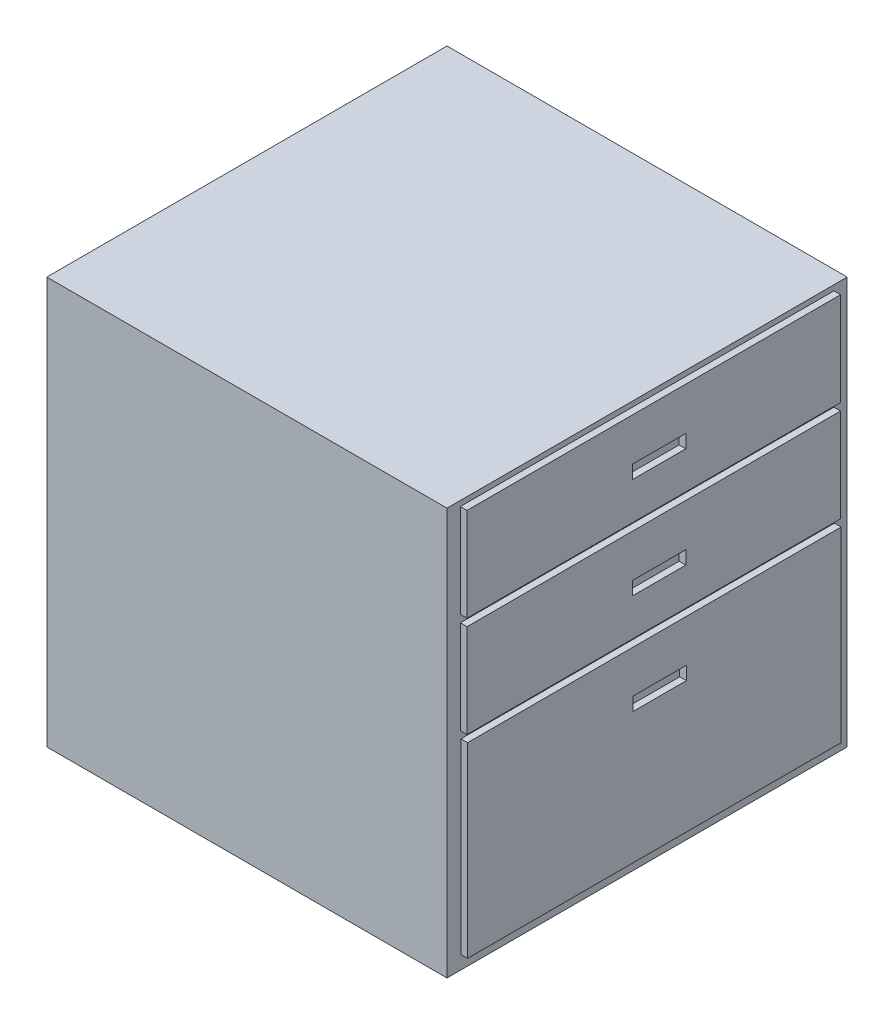
ISO-10303-21;
HEADER;
FILE_DESCRIPTION(('STEP AP214'),'2;1');
FILE_NAME('part.step','',(''),(''),'','','');
FILE_SCHEMA(('AUTOMOTIVE_DESIGN { 1 0 10303 214 1 1 1 1 }'));
ENDSEC;
DATA;
#1=APPLICATION_CONTEXT('core data for automotive mechanical design processes');
#2=APPLICATION_PROTOCOL_DEFINITION('international standard','automotive_design',2000,#1);
#3=PRODUCT_CONTEXT('',#1,'mechanical');
#4=PRODUCT('Part','Part','',(#3));
#5=PRODUCT_RELATED_PRODUCT_CATEGORY('part','',(#4));
#6=PRODUCT_DEFINITION_FORMATION('','',#4);
#7=PRODUCT_DEFINITION_CONTEXT('part definition',#1,'design');
#8=PRODUCT_DEFINITION('design','',#6,#7);
#9=PRODUCT_DEFINITION_SHAPE('','',#8);
#10=(LENGTH_UNIT() NAMED_UNIT(*) SI_UNIT(.MILLI.,.METRE.));
#11=(NAMED_UNIT(*) PLANE_ANGLE_UNIT() SI_UNIT($,.RADIAN.));
#12=(NAMED_UNIT(*) SI_UNIT($,.STERADIAN.) SOLID_ANGLE_UNIT());
#13=UNCERTAINTY_MEASURE_WITH_UNIT(LENGTH_MEASURE(1.E-05),#10,'distance_accuracy_value','');
#14=(GEOMETRIC_REPRESENTATION_CONTEXT(3) GLOBAL_UNCERTAINTY_ASSIGNED_CONTEXT((#13)) GLOBAL_UNIT_ASSIGNED_CONTEXT((#10,
#11,#12)) REPRESENTATION_CONTEXT('',''));
#15=CARTESIAN_POINT('',(0.,0.,0.));
#16=DIRECTION('',(0.,0.,1.));
#17=DIRECTION('',(1.,0.,0.));
#18=AXIS2_PLACEMENT_3D('',#15,#16,#17);
#19=CARTESIAN_POINT('',(0.,0.,600.));
#20=DIRECTION('',(-1.,0.,0.));
#21=DIRECTION('',(0.,-1.,0.));
#22=AXIS2_PLACEMENT_3D('',#19,#20,#21);
#23=PLANE('',#22);
#24=DIRECTION('',(0.,1.,0.));
#25=VECTOR('',#24,1.);
#26=CARTESIAN_POINT('',(0.,0.,0.));
#27=LINE('',#26,#25);
#28=CARTESIAN_POINT('',(0.,-610.,0.));
#29=VERTEX_POINT('',#28);
#30=CARTESIAN_POINT('',(0.,0.,0.));
#31=VERTEX_POINT('',#30);
#32=EDGE_CURVE('E413',#29,#31,#27,.T.);
#33=ORIENTED_EDGE('',*,*,#32,.T.);
#34=DIRECTION('',(0.,0.,-1.));
#35=VECTOR('',#34,1.);
#36=CARTESIAN_POINT('',(0.,0.,600.));
#37=LINE('',#36,#35);
#38=CARTESIAN_POINT('',(0.,0.,600.));
#39=VERTEX_POINT('',#38);
#40=EDGE_CURVE('E11',#39,#31,#37,.T.);
#41=ORIENTED_EDGE('',*,*,#40,.F.);
#42=DIRECTION('',(0.,1.,0.));
#43=VECTOR('',#42,1.);
#44=CARTESIAN_POINT('',(0.,0.,600.));
#45=LINE('',#44,#43);
#46=CARTESIAN_POINT('',(0.,-610.,600.));
#47=VERTEX_POINT('',#46);
#48=EDGE_CURVE('E414',#47,#39,#45,.T.);
#49=ORIENTED_EDGE('',*,*,#48,.F.);
#50=DIRECTION('',(0.,0.,-1.));
#51=VECTOR('',#50,1.);
#52=CARTESIAN_POINT('',(0.,-610.,600.));
#53=LINE('',#52,#51);
#54=EDGE_CURVE('E424',#47,#29,#53,.T.);
#55=ORIENTED_EDGE('',*,*,#54,.T.);
#56=EDGE_LOOP('',(#33,#41,#49,#55));
#57=FACE_BOUND('',#56,.T.);
#58=DIRECTION('',(0.,-1.,0.));
#59=VECTOR('',#58,1.);
#60=CARTESIAN_POINT('',(0.,-7.91383203609908,580.));
#61=LINE('',#60,#59);
#62=CARTESIAN_POINT('',(0.,-7.91383203609908,580.));
#63=VERTEX_POINT('',#62);
#64=CARTESIAN_POINT('',(0.,-147.913832036099,580.));
#65=VERTEX_POINT('',#64);
#66=EDGE_CURVE('E380',#63,#65,#61,.T.);
#67=ORIENTED_EDGE('',*,*,#66,.F.);
#68=DIRECTION('',(0.,0.,1.));
#69=VECTOR('',#68,1.);
#70=CARTESIAN_POINT('',(0.,-7.91383203609908,580.));
#71=LINE('',#70,#69);
#72=CARTESIAN_POINT('',(0.,-7.91383203609908,20.));
#73=VERTEX_POINT('',#72);
#74=EDGE_CURVE('E385',#73,#63,#71,.T.);
#75=ORIENTED_EDGE('',*,*,#74,.F.);
#76=DIRECTION('',(0.,1.,0.));
#77=VECTOR('',#76,1.);
#78=CARTESIAN_POINT('',(0.,-7.91383203609908,20.));
#79=LINE('',#78,#77);
#80=CARTESIAN_POINT('',(0.,-147.913832036099,20.));
#81=VERTEX_POINT('',#80);
#82=EDGE_CURVE('E397',#81,#73,#79,.T.);
#83=ORIENTED_EDGE('',*,*,#82,.F.);
#84=DIRECTION('',(0.,0.,-1.));
#85=VECTOR('',#84,1.);
#86=CARTESIAN_POINT('',(0.,-147.913832036099,580.));
#87=LINE('',#86,#85);
#88=EDGE_CURVE('E394',#65,#81,#87,.T.);
#89=ORIENTED_EDGE('',*,*,#88,.F.);
#90=EDGE_LOOP('',(#67,#75,#83,#89));
#91=FACE_BOUND('',#90,.T.);
#92=DIRECTION('',(0.,-1.,0.));
#93=VECTOR('',#92,1.);
#94=CARTESIAN_POINT('',(0.,-309.913832036099,579.167600112704));
#95=LINE('',#94,#93);
#96=CARTESIAN_POINT('',(0.,-309.913832036099,579.167600112704));
#97=VERTEX_POINT('',#96);
#98=CARTESIAN_POINT('',(0.,-589.913832036099,579.167600112704));
#99=VERTEX_POINT('',#98);
#100=EDGE_CURVE('E317',#97,#99,#95,.T.);
#101=ORIENTED_EDGE('',*,*,#100,.F.);
#102=DIRECTION('',(0.,0.,1.));
#103=VECTOR('',#102,1.);
#104=CARTESIAN_POINT('',(0.,-309.913832036099,579.167600112704));
#105=LINE('',#104,#103);
#106=CARTESIAN_POINT('',(0.,-309.913832036099,19.1676001127038));
#107=VERTEX_POINT('',#106);
#108=EDGE_CURVE('E322',#107,#97,#105,.T.);
#109=ORIENTED_EDGE('',*,*,#108,.F.);
#110=DIRECTION('',(0.,1.,0.));
#111=VECTOR('',#110,1.);
#112=CARTESIAN_POINT('',(0.,-309.913832036099,19.1676001127038));
#113=LINE('',#112,#111);
#114=CARTESIAN_POINT('',(0.,-589.913832036099,19.1676001127038));
#115=VERTEX_POINT('',#114);
#116=EDGE_CURVE('E334',#115,#107,#113,.T.);
#117=ORIENTED_EDGE('',*,*,#116,.F.);
#118=DIRECTION('',(0.,0.,-1.));
#119=VECTOR('',#118,1.);
#120=CARTESIAN_POINT('',(0.,-589.913832036099,579.167600112704));
#121=LINE('',#120,#119);
#122=EDGE_CURVE('E331',#99,#115,#121,.T.);
#123=ORIENTED_EDGE('',*,*,#122,.F.);
#124=EDGE_LOOP('',(#101,#109,#117,#123));
#125=FACE_BOUND('',#124,.T.);
#126=DIRECTION('',(0.,-1.,0.));
#127=VECTOR('',#126,1.);
#128=CARTESIAN_POINT('',(0.,-158.913832036099,579.999999999998));
#129=LINE('',#128,#127);
#130=CARTESIAN_POINT('',(0.,-158.913832036099,579.999999999998));
#131=VERTEX_POINT('',#130);
#132=CARTESIAN_POINT('',(0.,-298.913832036099,579.999999999998));
#133=VERTEX_POINT('',#132);
#134=EDGE_CURVE('E236',#131,#133,#129,.T.);
#135=ORIENTED_EDGE('',*,*,#134,.F.);
#136=DIRECTION('',(0.,0.,1.));
#137=VECTOR('',#136,1.);
#138=CARTESIAN_POINT('',(0.,-158.913832036099,579.999999999998));
#139=LINE('',#138,#137);
#140=CARTESIAN_POINT('',(0.,-158.913832036099,19.9999999999985));
#141=VERTEX_POINT('',#140);
#142=EDGE_CURVE('E264',#141,#131,#139,.T.);
#143=ORIENTED_EDGE('',*,*,#142,.F.);
#144=DIRECTION('',(0.,1.,0.));
#145=VECTOR('',#144,1.);
#146=CARTESIAN_POINT('',(0.,-158.913832036099,19.9999999999984));
#147=LINE('',#146,#145);
#148=CARTESIAN_POINT('',(0.,-298.913832036099,19.9999999999984));
#149=VERTEX_POINT('',#148);
#150=EDGE_CURVE('E54',#149,#141,#147,.T.);
#151=ORIENTED_EDGE('',*,*,#150,.F.);
#152=DIRECTION('',(0.,0.,-1.));
#153=VECTOR('',#152,1.);
#154=CARTESIAN_POINT('',(0.,-298.913832036099,579.999999999998));
#155=LINE('',#154,#153);
#156=EDGE_CURVE('E49',#133,#149,#155,.T.);
#157=ORIENTED_EDGE('',*,*,#156,.F.);
#158=EDGE_LOOP('',(#135,#143,#151,#157));
#159=FACE_BOUND('',#158,.T.);
#160=ADVANCED_FACE('F34',(#57,#91,#125,#159),#23,.F.);
#161=CARTESIAN_POINT('',(0.,0.,600.));
#162=DIRECTION('',(0.,-1.,0.));
#163=DIRECTION('',(1.,0.,0.));
#164=AXIS2_PLACEMENT_3D('',#161,#162,#163);
#165=PLANE('',#164);
#166=DIRECTION('',(-1.,0.,0.));
#167=VECTOR('',#166,1.);
#168=CARTESIAN_POINT('',(0.,0.,0.));
#169=LINE('',#168,#167);
#170=CARTESIAN_POINT('',(-600.,0.,0.));
#171=VERTEX_POINT('',#170);
#172=EDGE_CURVE('E427',#31,#171,#169,.T.);
#173=ORIENTED_EDGE('',*,*,#172,.T.);
#174=DIRECTION('',(0.,0.,-1.));
#175=VECTOR('',#174,1.);
#176=CARTESIAN_POINT('',(-600.,0.,600.));
#177=LINE('',#176,#175);
#178=CARTESIAN_POINT('',(-600.,0.,600.));
#179=VERTEX_POINT('',#178);
#180=EDGE_CURVE('E42',#179,#171,#177,.T.);
#181=ORIENTED_EDGE('',*,*,#180,.F.);
#182=DIRECTION('',(-1.,0.,0.));
#183=VECTOR('',#182,1.);
#184=CARTESIAN_POINT('',(0.,0.,600.));
#185=LINE('',#184,#183);
#186=EDGE_CURVE('E417',#39,#179,#185,.T.);
#187=ORIENTED_EDGE('',*,*,#186,.F.);
#188=ORIENTED_EDGE('',*,*,#40,.T.);
#189=EDGE_LOOP('',(#173,#181,#187,#188));
#190=FACE_BOUND('',#189,.T.);
#191=ADVANCED_FACE('F458',(#190),#165,.F.);
#192=CARTESIAN_POINT('',(-600.,0.,600.));
#193=DIRECTION('',(1.,0.,0.));
#194=DIRECTION('',(0.,0.,-1.));
#195=AXIS2_PLACEMENT_3D('',#192,#193,#194);
#196=PLANE('',#195);
#197=DIRECTION('',(0.,-1.,0.));
#198=VECTOR('',#197,1.);
#199=CARTESIAN_POINT('',(-600.,0.,0.));
#200=LINE('',#199,#198);
#201=CARTESIAN_POINT('',(-600.,-610.,0.));
#202=VERTEX_POINT('',#201);
#203=EDGE_CURVE('E429',#171,#202,#200,.T.);
#204=ORIENTED_EDGE('',*,*,#203,.T.);
#205=DIRECTION('',(0.,0.,-1.));
#206=VECTOR('',#205,1.);
#207=CARTESIAN_POINT('',(-600.,-610.,600.));
#208=LINE('',#207,#206);
#209=CARTESIAN_POINT('',(-600.,-610.,600.));
#210=VERTEX_POINT('',#209);
#211=EDGE_CURVE('E434',#210,#202,#208,.T.);
#212=ORIENTED_EDGE('',*,*,#211,.F.);
#213=DIRECTION('',(0.,-1.,0.));
#214=VECTOR('',#213,1.);
#215=CARTESIAN_POINT('',(-600.,0.,600.));
#216=LINE('',#215,#214);
#217=EDGE_CURVE('E420',#179,#210,#216,.T.);
#218=ORIENTED_EDGE('',*,*,#217,.F.);
#219=ORIENTED_EDGE('',*,*,#180,.T.);
#220=EDGE_LOOP('',(#204,#212,#218,#219));
#221=FACE_BOUND('',#220,.T.);
#222=ADVANCED_FACE('F441',(#221),#196,.F.);
#223=CARTESIAN_POINT('',(0.,-610.,600.));
#224=DIRECTION('',(0.,1.,0.));
#225=DIRECTION('',(-1.,0.,0.));
#226=AXIS2_PLACEMENT_3D('',#223,#224,#225);
#227=PLANE('',#226);
#228=DIRECTION('',(1.,0.,0.));
#229=VECTOR('',#228,1.);
#230=CARTESIAN_POINT('',(0.,-610.,0.));
#231=LINE('',#230,#229);
#232=EDGE_CURVE('E418',#202,#29,#231,.T.);
#233=ORIENTED_EDGE('',*,*,#232,.T.);
#234=ORIENTED_EDGE('',*,*,#54,.F.);
#235=DIRECTION('',(1.,0.,0.));
#236=VECTOR('',#235,1.);
#237=CARTESIAN_POINT('',(0.,-610.,600.));
#238=LINE('',#237,#236);
#239=EDGE_CURVE('E422',#210,#47,#238,.T.);
#240=ORIENTED_EDGE('',*,*,#239,.F.);
#241=ORIENTED_EDGE('',*,*,#211,.T.);
#242=EDGE_LOOP('',(#233,#234,#240,#241));
#243=FACE_BOUND('',#242,.T.);
#244=ADVANCED_FACE('F450',(#243),#227,.F.);
#245=CARTESIAN_POINT('',(0.,0.,600.));
#246=DIRECTION('',(0.,0.,-1.));
#247=DIRECTION('',(-1.,0.,0.));
#248=AXIS2_PLACEMENT_3D('',#245,#246,#247);
#249=PLANE('',#248);
#250=ORIENTED_EDGE('',*,*,#48,.T.);
#251=ORIENTED_EDGE('',*,*,#186,.T.);
#252=ORIENTED_EDGE('',*,*,#217,.T.);
#253=ORIENTED_EDGE('',*,*,#239,.T.);
#254=EDGE_LOOP('',(#250,#251,#252,#253));
#255=FACE_BOUND('',#254,.T.);
#256=ADVANCED_FACE('F457',(#255),#249,.F.);
#257=CARTESIAN_POINT('',(0.,0.,0.));
#258=DIRECTION('',(0.,0.,-1.));
#259=DIRECTION('',(-1.,0.,0.));
#260=AXIS2_PLACEMENT_3D('',#257,#258,#259);
#261=PLANE('',#260);
#262=ORIENTED_EDGE('',*,*,#32,.F.);
#263=ORIENTED_EDGE('',*,*,#232,.F.);
#264=ORIENTED_EDGE('',*,*,#203,.F.);
#265=ORIENTED_EDGE('',*,*,#172,.F.);
#266=EDGE_LOOP('',(#262,#263,#264,#265));
#267=FACE_BOUND('',#266,.T.);
#268=ADVANCED_FACE('F447',(#267),#261,.T.);
#269=CARTESIAN_POINT('',(10.,0.,0.));
#270=DIRECTION('',(1.,0.,0.));
#271=DIRECTION('',(0.,1.,0.));
#272=AXIS2_PLACEMENT_3D('',#269,#270,#271);
#273=PLANE('',#272);
#274=DIRECTION('',(0.,-1.,0.));
#275=VECTOR('',#274,1.);
#276=CARTESIAN_POINT('',(10.,-7.91383203609908,580.));
#277=LINE('',#276,#275);
#278=CARTESIAN_POINT('',(10.,-7.91383203609908,580.));
#279=VERTEX_POINT('',#278);
#280=CARTESIAN_POINT('',(10.,-147.913832036099,580.));
#281=VERTEX_POINT('',#280);
#282=EDGE_CURVE('E381',#279,#281,#277,.T.);
#283=ORIENTED_EDGE('',*,*,#282,.T.);
#284=DIRECTION('',(0.,0.,-1.));
#285=VECTOR('',#284,1.);
#286=CARTESIAN_POINT('',(10.,-147.913832036099,580.));
#287=LINE('',#286,#285);
#288=CARTESIAN_POINT('',(10.,-147.913832036099,20.));
#289=VERTEX_POINT('',#288);
#290=EDGE_CURVE('E384',#281,#289,#287,.T.);
#291=ORIENTED_EDGE('',*,*,#290,.T.);
#292=DIRECTION('',(0.,1.,0.));
#293=VECTOR('',#292,1.);
#294=CARTESIAN_POINT('',(10.,-7.91383203609908,20.));
#295=LINE('',#294,#293);
#296=CARTESIAN_POINT('',(10.,-7.91383203609908,20.));
#297=VERTEX_POINT('',#296);
#298=EDGE_CURVE('E387',#289,#297,#295,.T.);
#299=ORIENTED_EDGE('',*,*,#298,.T.);
#300=DIRECTION('',(0.,0.,1.));
#301=VECTOR('',#300,1.);
#302=CARTESIAN_POINT('',(10.,-7.91383203609908,580.));
#303=LINE('',#302,#301);
#304=EDGE_CURVE('E389',#297,#279,#303,.T.);
#305=ORIENTED_EDGE('',*,*,#304,.T.);
#306=EDGE_LOOP('',(#283,#291,#299,#305));
#307=FACE_BOUND('',#306,.T.);
#308=DIRECTION('',(0.,0.,-1.));
#309=VECTOR('',#308,1.);
#310=CARTESIAN_POINT('',(10.,-91.9138320360991,332.));
#311=LINE('',#310,#309);
#312=CARTESIAN_POINT('',(10.,-91.9138320360991,332.));
#313=VERTEX_POINT('',#312);
#314=CARTESIAN_POINT('',(10.,-91.9138320360991,252.));
#315=VERTEX_POINT('',#314);
#316=EDGE_CURVE('E353',#313,#315,#311,.T.);
#317=ORIENTED_EDGE('',*,*,#316,.F.);
#318=DIRECTION('',(0.,-1.,0.));
#319=VECTOR('',#318,1.);
#320=CARTESIAN_POINT('',(10.,-71.9138320360991,332.));
#321=LINE('',#320,#319);
#322=CARTESIAN_POINT('',(10.,-71.9138320360991,332.));
#323=VERTEX_POINT('',#322);
#324=EDGE_CURVE('E351',#323,#313,#321,.T.);
#325=ORIENTED_EDGE('',*,*,#324,.F.);
#326=DIRECTION('',(0.,0.,1.));
#327=VECTOR('',#326,1.);
#328=CARTESIAN_POINT('',(10.,-71.9138320360991,332.));
#329=LINE('',#328,#327);
#330=CARTESIAN_POINT('',(10.,-71.9138320360991,252.));
#331=VERTEX_POINT('',#330);
#332=EDGE_CURVE('E359',#331,#323,#329,.T.);
#333=ORIENTED_EDGE('',*,*,#332,.F.);
#334=DIRECTION('',(0.,1.,0.));
#335=VECTOR('',#334,1.);
#336=CARTESIAN_POINT('',(10.,-71.9138320360991,252.));
#337=LINE('',#336,#335);
#338=EDGE_CURVE('E356',#315,#331,#337,.T.);
#339=ORIENTED_EDGE('',*,*,#338,.F.);
#340=EDGE_LOOP('',(#317,#325,#333,#339));
#341=FACE_BOUND('',#340,.T.);
#342=ADVANCED_FACE('F471',(#307,#341),#273,.T.);
#343=CARTESIAN_POINT('',(10.,-7.91383203609908,580.));
#344=DIRECTION('',(0.,0.,-1.));
#345=DIRECTION('',(-1.,0.,0.));
#346=AXIS2_PLACEMENT_3D('',#343,#344,#345);
#347=PLANE('',#346);
#348=ORIENTED_EDGE('',*,*,#66,.T.);
#349=DIRECTION('',(-1.,0.,0.));
#350=VECTOR('',#349,1.);
#351=CARTESIAN_POINT('',(10.,-147.913832036099,580.));
#352=LINE('',#351,#350);
#353=EDGE_CURVE('E410',#281,#65,#352,.T.);
#354=ORIENTED_EDGE('',*,*,#353,.F.);
#355=ORIENTED_EDGE('',*,*,#282,.F.);
#356=DIRECTION('',(-1.,0.,0.));
#357=VECTOR('',#356,1.);
#358=CARTESIAN_POINT('',(10.,-7.91383203609908,580.));
#359=LINE('',#358,#357);
#360=EDGE_CURVE('E391',#279,#63,#359,.T.);
#361=ORIENTED_EDGE('',*,*,#360,.T.);
#362=EDGE_LOOP('',(#348,#354,#355,#361));
#363=FACE_BOUND('',#362,.T.);
#364=ADVANCED_FACE('F474',(#363),#347,.F.);
#365=CARTESIAN_POINT('',(10.,-147.913832036099,580.));
#366=DIRECTION('',(0.,1.,0.));
#367=DIRECTION('',(-1.,0.,0.));
#368=AXIS2_PLACEMENT_3D('',#365,#366,#367);
#369=PLANE('',#368);
#370=ORIENTED_EDGE('',*,*,#88,.T.);
#371=DIRECTION('',(-1.,0.,0.));
#372=VECTOR('',#371,1.);
#373=CARTESIAN_POINT('',(10.,-147.913832036099,20.));
#374=LINE('',#373,#372);
#375=EDGE_CURVE('E407',#289,#81,#374,.T.);
#376=ORIENTED_EDGE('',*,*,#375,.F.);
#377=ORIENTED_EDGE('',*,*,#290,.F.);
#378=ORIENTED_EDGE('',*,*,#353,.T.);
#379=EDGE_LOOP('',(#370,#376,#377,#378));
#380=FACE_BOUND('',#379,.T.);
#381=ADVANCED_FACE('F477',(#380),#369,.F.);
#382=CARTESIAN_POINT('',(10.,-7.91383203609908,20.));
#383=DIRECTION('',(0.,0.,1.));
#384=DIRECTION('',(1.,0.,0.));
#385=AXIS2_PLACEMENT_3D('',#382,#383,#384);
#386=PLANE('',#385);
#387=ORIENTED_EDGE('',*,*,#82,.T.);
#388=DIRECTION('',(-1.,0.,0.));
#389=VECTOR('',#388,1.);
#390=CARTESIAN_POINT('',(10.,-7.91383203609908,20.));
#391=LINE('',#390,#389);
#392=EDGE_CURVE('E404',#297,#73,#391,.T.);
#393=ORIENTED_EDGE('',*,*,#392,.F.);
#394=ORIENTED_EDGE('',*,*,#298,.F.);
#395=ORIENTED_EDGE('',*,*,#375,.T.);
#396=EDGE_LOOP('',(#387,#393,#394,#395));
#397=FACE_BOUND('',#396,.T.);
#398=ADVANCED_FACE('F481',(#397),#386,.F.);
#399=CARTESIAN_POINT('',(10.,-7.91383203609908,580.));
#400=DIRECTION('',(0.,-1.,0.));
#401=DIRECTION('',(1.,0.,0.));
#402=AXIS2_PLACEMENT_3D('',#399,#400,#401);
#403=PLANE('',#402);
#404=ORIENTED_EDGE('',*,*,#74,.T.);
#405=ORIENTED_EDGE('',*,*,#360,.F.);
#406=ORIENTED_EDGE('',*,*,#304,.F.);
#407=ORIENTED_EDGE('',*,*,#392,.T.);
#408=EDGE_LOOP('',(#404,#405,#406,#407));
#409=FACE_BOUND('',#408,.T.);
#410=ADVANCED_FACE('F485',(#409),#403,.F.);
#411=CARTESIAN_POINT('',(10.,-71.9138320360991,332.));
#412=DIRECTION('',(0.,0.,-1.));
#413=DIRECTION('',(-1.,0.,0.));
#414=AXIS2_PLACEMENT_3D('',#411,#412,#413);
#415=PLANE('',#414);
#416=DIRECTION('',(0.,-1.,0.));
#417=VECTOR('',#416,1.);
#418=CARTESIAN_POINT('',(0.,-71.9138320360991,332.));
#419=LINE('',#418,#417);
#420=CARTESIAN_POINT('',(0.,-71.9138320360991,332.));
#421=VERTEX_POINT('',#420);
#422=CARTESIAN_POINT('',(0.,-91.9138320360991,332.));
#423=VERTEX_POINT('',#422);
#424=EDGE_CURVE('E350',#421,#423,#419,.T.);
#425=ORIENTED_EDGE('',*,*,#424,.F.);
#426=DIRECTION('',(-1.,0.,0.));
#427=VECTOR('',#426,1.);
#428=CARTESIAN_POINT('',(10.,-71.9138320360991,332.));
#429=LINE('',#428,#427);
#430=EDGE_CURVE('E361',#323,#421,#429,.T.);
#431=ORIENTED_EDGE('',*,*,#430,.F.);
#432=ORIENTED_EDGE('',*,*,#324,.T.);
#433=DIRECTION('',(-1.,0.,0.));
#434=VECTOR('',#433,1.);
#435=CARTESIAN_POINT('',(10.,-91.9138320360991,332.));
#436=LINE('',#435,#434);
#437=EDGE_CURVE('E377',#313,#423,#436,.T.);
#438=ORIENTED_EDGE('',*,*,#437,.T.);
#439=EDGE_LOOP('',(#425,#431,#432,#438));
#440=FACE_BOUND('',#439,.T.);
#441=ADVANCED_FACE('F489',(#440),#415,.T.);
#442=CARTESIAN_POINT('',(10.,-91.9138320360991,332.));
#443=DIRECTION('',(0.,1.,0.));
#444=DIRECTION('',(-1.,0.,0.));
#445=AXIS2_PLACEMENT_3D('',#442,#443,#444);
#446=PLANE('',#445);
#447=DIRECTION('',(0.,0.,-1.));
#448=VECTOR('',#447,1.);
#449=CARTESIAN_POINT('',(0.,-91.9138320360991,332.));
#450=LINE('',#449,#448);
#451=CARTESIAN_POINT('',(0.,-91.9138320360991,252.));
#452=VERTEX_POINT('',#451);
#453=EDGE_CURVE('E364',#423,#452,#450,.T.);
#454=ORIENTED_EDGE('',*,*,#453,.F.);
#455=ORIENTED_EDGE('',*,*,#437,.F.);
#456=ORIENTED_EDGE('',*,*,#316,.T.);
#457=DIRECTION('',(-1.,0.,0.));
#458=VECTOR('',#457,1.);
#459=CARTESIAN_POINT('',(10.,-91.9138320360991,252.));
#460=LINE('',#459,#458);
#461=EDGE_CURVE('E375',#315,#452,#460,.T.);
#462=ORIENTED_EDGE('',*,*,#461,.T.);
#463=EDGE_LOOP('',(#454,#455,#456,#462));
#464=FACE_BOUND('',#463,.T.);
#465=ADVANCED_FACE('F496',(#464),#446,.T.);
#466=CARTESIAN_POINT('',(10.,-71.9138320360991,252.));
#467=DIRECTION('',(0.,0.,1.));
#468=DIRECTION('',(1.,0.,0.));
#469=AXIS2_PLACEMENT_3D('',#466,#467,#468);
#470=PLANE('',#469);
#471=DIRECTION('',(0.,1.,0.));
#472=VECTOR('',#471,1.);
#473=CARTESIAN_POINT('',(0.,-71.9138320360991,252.));
#474=LINE('',#473,#472);
#475=CARTESIAN_POINT('',(0.,-71.9138320360991,252.));
#476=VERTEX_POINT('',#475);
#477=EDGE_CURVE('E367',#452,#476,#474,.T.);
#478=ORIENTED_EDGE('',*,*,#477,.F.);
#479=ORIENTED_EDGE('',*,*,#461,.F.);
#480=ORIENTED_EDGE('',*,*,#338,.T.);
#481=DIRECTION('',(-1.,0.,0.));
#482=VECTOR('',#481,1.);
#483=CARTESIAN_POINT('',(10.,-71.9138320360991,252.));
#484=LINE('',#483,#482);
#485=EDGE_CURVE('E373',#331,#476,#484,.T.);
#486=ORIENTED_EDGE('',*,*,#485,.T.);
#487=EDGE_LOOP('',(#478,#479,#480,#486));
#488=FACE_BOUND('',#487,.T.);
#489=ADVANCED_FACE('F500',(#488),#470,.T.);
#490=CARTESIAN_POINT('',(10.,-71.9138320360991,332.));
#491=DIRECTION('',(0.,-1.,0.));
#492=DIRECTION('',(1.,0.,0.));
#493=AXIS2_PLACEMENT_3D('',#490,#491,#492);
#494=PLANE('',#493);
#495=DIRECTION('',(0.,0.,1.));
#496=VECTOR('',#495,1.);
#497=CARTESIAN_POINT('',(0.,-71.9138320360991,332.));
#498=LINE('',#497,#496);
#499=EDGE_CURVE('E354',#476,#421,#498,.T.);
#500=ORIENTED_EDGE('',*,*,#499,.F.);
#501=ORIENTED_EDGE('',*,*,#485,.F.);
#502=ORIENTED_EDGE('',*,*,#332,.T.);
#503=ORIENTED_EDGE('',*,*,#430,.T.);
#504=EDGE_LOOP('',(#500,#501,#502,#503));
#505=FACE_BOUND('',#504,.T.);
#506=ADVANCED_FACE('F504',(#505),#494,.T.);
#507=ORIENTED_EDGE('',*,*,#499,.T.);
#508=ORIENTED_EDGE('',*,*,#424,.T.);
#509=ORIENTED_EDGE('',*,*,#453,.T.);
#510=ORIENTED_EDGE('',*,*,#477,.T.);
#511=EDGE_LOOP('',(#507,#508,#509,#510));
#512=FACE_BOUND('',#511,.T.);
#513=ADVANCED_FACE('F36',(#512),#23,.F.);
#514=CARTESIAN_POINT('',(10.,0.,0.));
#515=DIRECTION('',(1.,0.,0.));
#516=DIRECTION('',(0.,1.,0.));
#517=AXIS2_PLACEMENT_3D('',#514,#515,#516);
#518=PLANE('',#517);
#519=DIRECTION('',(0.,-1.,0.));
#520=VECTOR('',#519,1.);
#521=CARTESIAN_POINT('',(10.,-309.913832036099,579.167600112704));
#522=LINE('',#521,#520);
#523=CARTESIAN_POINT('',(10.,-309.913832036099,579.167600112704));
#524=VERTEX_POINT('',#523);
#525=CARTESIAN_POINT('',(10.0000000000001,-589.913832036099,579.167600112704));
#526=VERTEX_POINT('',#525);
#527=EDGE_CURVE('E318',#524,#526,#522,.T.);
#528=ORIENTED_EDGE('',*,*,#527,.T.);
#529=DIRECTION('',(0.,0.,-1.));
#530=VECTOR('',#529,1.);
#531=CARTESIAN_POINT('',(10.0000000000001,-589.913832036099,579.167600112704));
#532=LINE('',#531,#530);
#533=CARTESIAN_POINT('',(10.0000000000001,-589.913832036099,19.1676001127038));
#534=VERTEX_POINT('',#533);
#535=EDGE_CURVE('E321',#526,#534,#532,.T.);
#536=ORIENTED_EDGE('',*,*,#535,.T.);
#537=DIRECTION('',(0.,1.,0.));
#538=VECTOR('',#537,1.);
#539=CARTESIAN_POINT('',(10.,-309.913832036099,19.1676001127038));
#540=LINE('',#539,#538);
#541=CARTESIAN_POINT('',(10.,-309.913832036099,19.1676001127038));
#542=VERTEX_POINT('',#541);
#543=EDGE_CURVE('E324',#534,#542,#540,.T.);
#544=ORIENTED_EDGE('',*,*,#543,.T.);
#545=DIRECTION('',(0.,0.,1.));
#546=VECTOR('',#545,1.);
#547=CARTESIAN_POINT('',(10.,-309.913832036099,579.167600112704));
#548=LINE('',#547,#546);
#549=EDGE_CURVE('E326',#542,#524,#548,.T.);
#550=ORIENTED_EDGE('',*,*,#549,.T.);
#551=EDGE_LOOP('',(#528,#536,#544,#550));
#552=FACE_BOUND('',#551,.T.);
#553=DIRECTION('',(0.,0.,-1.));
#554=VECTOR('',#553,1.);
#555=CARTESIAN_POINT('',(10.,-393.400082600603,331.167600112704));
#556=LINE('',#555,#554);
#557=CARTESIAN_POINT('',(10.,-393.400082600603,331.167600112704));
#558=VERTEX_POINT('',#557);
#559=CARTESIAN_POINT('',(10.,-393.400082600603,251.167600112704));
#560=VERTEX_POINT('',#559);
#561=EDGE_CURVE('E290',#558,#560,#556,.T.);
#562=ORIENTED_EDGE('',*,*,#561,.F.);
#563=DIRECTION('',(0.,-1.,0.));
#564=VECTOR('',#563,1.);
#565=CARTESIAN_POINT('',(10.,-373.400082600603,331.167600112704));
#566=LINE('',#565,#564);
#567=CARTESIAN_POINT('',(10.,-373.400082600603,331.167600112704));
#568=VERTEX_POINT('',#567);
#569=EDGE_CURVE('E288',#568,#558,#566,.T.);
#570=ORIENTED_EDGE('',*,*,#569,.F.);
#571=DIRECTION('',(0.,0.,1.));
#572=VECTOR('',#571,1.);
#573=CARTESIAN_POINT('',(10.,-373.400082600603,331.167600112704));
#574=LINE('',#573,#572);
#575=CARTESIAN_POINT('',(10.,-373.400082600603,251.167600112704));
#576=VERTEX_POINT('',#575);
#577=EDGE_CURVE('E296',#576,#568,#574,.T.);
#578=ORIENTED_EDGE('',*,*,#577,.F.);
#579=DIRECTION('',(0.,1.,0.));
#580=VECTOR('',#579,1.);
#581=CARTESIAN_POINT('',(10.,-373.400082600603,251.167600112704));
#582=LINE('',#581,#580);
#583=EDGE_CURVE('E293',#560,#576,#582,.T.);
#584=ORIENTED_EDGE('',*,*,#583,.F.);
#585=EDGE_LOOP('',(#562,#570,#578,#584));
#586=FACE_BOUND('',#585,.T.);
#587=ADVANCED_FACE('F513',(#552,#586),#518,.T.);
#588=CARTESIAN_POINT('',(10.,-309.913832036099,579.167600112704));
#589=DIRECTION('',(0.,0.,-1.));
#590=DIRECTION('',(-1.,0.,0.));
#591=AXIS2_PLACEMENT_3D('',#588,#589,#590);
#592=PLANE('',#591);
#593=ORIENTED_EDGE('',*,*,#100,.T.);
#594=DIRECTION('',(-1.,0.,0.));
#595=VECTOR('',#594,1.);
#596=CARTESIAN_POINT('',(10.0000000000001,-589.913832036099,579.167600112704));
#597=LINE('',#596,#595);
#598=EDGE_CURVE('E347',#526,#99,#597,.T.);
#599=ORIENTED_EDGE('',*,*,#598,.F.);
#600=ORIENTED_EDGE('',*,*,#527,.F.);
#601=DIRECTION('',(-1.,0.,0.));
#602=VECTOR('',#601,1.);
#603=CARTESIAN_POINT('',(10.,-309.913832036099,579.167600112704));
#604=LINE('',#603,#602);
#605=EDGE_CURVE('E328',#524,#97,#604,.T.);
#606=ORIENTED_EDGE('',*,*,#605,.T.);
#607=EDGE_LOOP('',(#593,#599,#600,#606));
#608=FACE_BOUND('',#607,.T.);
#609=ADVANCED_FACE('F509',(#608),#592,.F.);
#610=CARTESIAN_POINT('',(10.0000000000001,-589.913832036099,579.167600112704));
#611=DIRECTION('',(0.,1.,0.));
#612=DIRECTION('',(-1.,0.,0.));
#613=AXIS2_PLACEMENT_3D('',#610,#611,#612);
#614=PLANE('',#613);
#615=ORIENTED_EDGE('',*,*,#122,.T.);
#616=DIRECTION('',(-1.,0.,0.));
#617=VECTOR('',#616,1.);
#618=CARTESIAN_POINT('',(10.0000000000001,-589.913832036099,19.1676001127038));
#619=LINE('',#618,#617);
#620=EDGE_CURVE('E344',#534,#115,#619,.T.);
#621=ORIENTED_EDGE('',*,*,#620,.F.);
#622=ORIENTED_EDGE('',*,*,#535,.F.);
#623=ORIENTED_EDGE('',*,*,#598,.T.);
#624=EDGE_LOOP('',(#615,#621,#622,#623));
#625=FACE_BOUND('',#624,.T.);
#626=ADVANCED_FACE('F512',(#625),#614,.F.);
#627=CARTESIAN_POINT('',(10.,-309.913832036099,19.1676001127038));
#628=DIRECTION('',(0.,0.,1.));
#629=DIRECTION('',(1.,0.,0.));
#630=AXIS2_PLACEMENT_3D('',#627,#628,#629);
#631=PLANE('',#630);
#632=ORIENTED_EDGE('',*,*,#116,.T.);
#633=DIRECTION('',(-1.,0.,0.));
#634=VECTOR('',#633,1.);
#635=CARTESIAN_POINT('',(10.,-309.913832036099,19.1676001127038));
#636=LINE('',#635,#634);
#637=EDGE_CURVE('E341',#542,#107,#636,.T.);
#638=ORIENTED_EDGE('',*,*,#637,.F.);
#639=ORIENTED_EDGE('',*,*,#543,.F.);
#640=ORIENTED_EDGE('',*,*,#620,.T.);
#641=EDGE_LOOP('',(#632,#638,#639,#640));
#642=FACE_BOUND('',#641,.T.);
#643=ADVANCED_FACE('F517',(#642),#631,.F.);
#644=CARTESIAN_POINT('',(10.,-309.913832036099,579.167600112704));
#645=DIRECTION('',(0.,-1.,0.));
#646=DIRECTION('',(1.,0.,0.));
#647=AXIS2_PLACEMENT_3D('',#644,#645,#646);
#648=PLANE('',#647);
#649=ORIENTED_EDGE('',*,*,#108,.T.);
#650=ORIENTED_EDGE('',*,*,#605,.F.);
#651=ORIENTED_EDGE('',*,*,#549,.F.);
#652=ORIENTED_EDGE('',*,*,#637,.T.);
#653=EDGE_LOOP('',(#649,#650,#651,#652));
#654=FACE_BOUND('',#653,.T.);
#655=ADVANCED_FACE('F521',(#654),#648,.F.);
#656=CARTESIAN_POINT('',(10.,-373.400082600603,331.167600112704));
#657=DIRECTION('',(0.,0.,-1.));
#658=DIRECTION('',(-1.,0.,0.));
#659=AXIS2_PLACEMENT_3D('',#656,#657,#658);
#660=PLANE('',#659);
#661=DIRECTION('',(0.,-1.,0.));
#662=VECTOR('',#661,1.);
#663=CARTESIAN_POINT('',(0.,-373.400082600603,331.167600112704));
#664=LINE('',#663,#662);
#665=CARTESIAN_POINT('',(0.,-373.400082600603,331.167600112704));
#666=VERTEX_POINT('',#665);
#667=CARTESIAN_POINT('',(0.,-393.400082600603,331.167600112704));
#668=VERTEX_POINT('',#667);
#669=EDGE_CURVE('E287',#666,#668,#664,.T.);
#670=ORIENTED_EDGE('',*,*,#669,.F.);
#671=DIRECTION('',(-1.,0.,0.));
#672=VECTOR('',#671,1.);
#673=CARTESIAN_POINT('',(10.,-373.400082600603,331.167600112704));
#674=LINE('',#673,#672);
#675=EDGE_CURVE('E298',#568,#666,#674,.T.);
#676=ORIENTED_EDGE('',*,*,#675,.F.);
#677=ORIENTED_EDGE('',*,*,#569,.T.);
#678=DIRECTION('',(-1.,0.,0.));
#679=VECTOR('',#678,1.);
#680=CARTESIAN_POINT('',(10.,-393.400082600603,331.167600112704));
#681=LINE('',#680,#679);
#682=EDGE_CURVE('E314',#558,#668,#681,.T.);
#683=ORIENTED_EDGE('',*,*,#682,.T.);
#684=EDGE_LOOP('',(#670,#676,#677,#683));
#685=FACE_BOUND('',#684,.T.);
#686=ADVANCED_FACE('F525',(#685),#660,.T.);
#687=CARTESIAN_POINT('',(10.,-393.400082600603,331.167600112704));
#688=DIRECTION('',(0.,1.,0.));
#689=DIRECTION('',(-1.,0.,0.));
#690=AXIS2_PLACEMENT_3D('',#687,#688,#689);
#691=PLANE('',#690);
#692=DIRECTION('',(0.,0.,-1.));
#693=VECTOR('',#692,1.);
#694=CARTESIAN_POINT('',(0.,-393.400082600603,331.167600112704));
#695=LINE('',#694,#693);
#696=CARTESIAN_POINT('',(0.,-393.400082600603,251.167600112704));
#697=VERTEX_POINT('',#696);
#698=EDGE_CURVE('E301',#668,#697,#695,.T.);
#699=ORIENTED_EDGE('',*,*,#698,.F.);
#700=ORIENTED_EDGE('',*,*,#682,.F.);
#701=ORIENTED_EDGE('',*,*,#561,.T.);
#702=DIRECTION('',(-1.,0.,0.));
#703=VECTOR('',#702,1.);
#704=CARTESIAN_POINT('',(10.,-393.400082600603,251.167600112704));
#705=LINE('',#704,#703);
#706=EDGE_CURVE('E312',#560,#697,#705,.T.);
#707=ORIENTED_EDGE('',*,*,#706,.T.);
#708=EDGE_LOOP('',(#699,#700,#701,#707));
#709=FACE_BOUND('',#708,.T.);
#710=ADVANCED_FACE('F532',(#709),#691,.T.);
#711=CARTESIAN_POINT('',(10.,-373.400082600603,251.167600112704));
#712=DIRECTION('',(0.,0.,1.));
#713=DIRECTION('',(1.,0.,0.));
#714=AXIS2_PLACEMENT_3D('',#711,#712,#713);
#715=PLANE('',#714);
#716=DIRECTION('',(0.,1.,0.));
#717=VECTOR('',#716,1.);
#718=CARTESIAN_POINT('',(0.,-373.400082600603,251.167600112704));
#719=LINE('',#718,#717);
#720=CARTESIAN_POINT('',(0.,-373.400082600603,251.167600112704));
#721=VERTEX_POINT('',#720);
#722=EDGE_CURVE('E304',#697,#721,#719,.T.);
#723=ORIENTED_EDGE('',*,*,#722,.F.);
#724=ORIENTED_EDGE('',*,*,#706,.F.);
#725=ORIENTED_EDGE('',*,*,#583,.T.);
#726=DIRECTION('',(-1.,0.,0.));
#727=VECTOR('',#726,1.);
#728=CARTESIAN_POINT('',(10.,-373.400082600603,251.167600112704));
#729=LINE('',#728,#727);
#730=EDGE_CURVE('E310',#576,#721,#729,.T.);
#731=ORIENTED_EDGE('',*,*,#730,.T.);
#732=EDGE_LOOP('',(#723,#724,#725,#731));
#733=FACE_BOUND('',#732,.T.);
#734=ADVANCED_FACE('F536',(#733),#715,.T.);
#735=CARTESIAN_POINT('',(10.,-373.400082600603,331.167600112704));
#736=DIRECTION('',(0.,-1.,0.));
#737=DIRECTION('',(1.,0.,0.));
#738=AXIS2_PLACEMENT_3D('',#735,#736,#737);
#739=PLANE('',#738);
#740=DIRECTION('',(0.,0.,1.));
#741=VECTOR('',#740,1.);
#742=CARTESIAN_POINT('',(0.,-373.400082600603,331.167600112704));
#743=LINE('',#742,#741);
#744=EDGE_CURVE('E291',#721,#666,#743,.T.);
#745=ORIENTED_EDGE('',*,*,#744,.F.);
#746=ORIENTED_EDGE('',*,*,#730,.F.);
#747=ORIENTED_EDGE('',*,*,#577,.T.);
#748=ORIENTED_EDGE('',*,*,#675,.T.);
#749=EDGE_LOOP('',(#745,#746,#747,#748));
#750=FACE_BOUND('',#749,.T.);
#751=ADVANCED_FACE('F540',(#750),#739,.T.);
#752=ORIENTED_EDGE('',*,*,#744,.T.);
#753=ORIENTED_EDGE('',*,*,#669,.T.);
#754=ORIENTED_EDGE('',*,*,#698,.T.);
#755=ORIENTED_EDGE('',*,*,#722,.T.);
#756=EDGE_LOOP('',(#752,#753,#754,#755));
#757=FACE_BOUND('',#756,.T.);
#758=ADVANCED_FACE('F544',(#757),#23,.F.);
#759=CARTESIAN_POINT('',(10.,0.,0.));
#760=DIRECTION('',(1.,0.,0.));
#761=DIRECTION('',(0.,1.,0.));
#762=AXIS2_PLACEMENT_3D('',#759,#760,#761);
#763=PLANE('',#762);
#764=DIRECTION('',(0.,-1.,0.));
#765=VECTOR('',#764,1.);
#766=CARTESIAN_POINT('',(10.,-158.913832036099,579.999999999998));
#767=LINE('',#766,#765);
#768=CARTESIAN_POINT('',(10.,-158.913832036099,579.999999999998));
#769=VERTEX_POINT('',#768);
#770=CARTESIAN_POINT('',(10.,-298.913832036099,579.999999999998));
#771=VERTEX_POINT('',#770);
#772=EDGE_CURVE('E260',#769,#771,#767,.T.);
#773=ORIENTED_EDGE('',*,*,#772,.T.);
#774=DIRECTION('',(0.,0.,-1.));
#775=VECTOR('',#774,1.);
#776=CARTESIAN_POINT('',(10.,-298.913832036099,579.999999999998));
#777=LINE('',#776,#775);
#778=CARTESIAN_POINT('',(10.,-298.913832036099,19.9999999999984));
#779=VERTEX_POINT('',#778);
#780=EDGE_CURVE('E263',#771,#779,#777,.T.);
#781=ORIENTED_EDGE('',*,*,#780,.T.);
#782=DIRECTION('',(0.,1.,0.));
#783=VECTOR('',#782,1.);
#784=CARTESIAN_POINT('',(10.,-158.913832036099,19.9999999999984));
#785=LINE('',#784,#783);
#786=CARTESIAN_POINT('',(10.,-158.913832036099,19.9999999999984));
#787=VERTEX_POINT('',#786);
#788=EDGE_CURVE('E266',#779,#787,#785,.T.);
#789=ORIENTED_EDGE('',*,*,#788,.T.);
#790=DIRECTION('',(0.,0.,1.));
#791=VECTOR('',#790,1.);
#792=CARTESIAN_POINT('',(10.,-158.913832036099,579.999999999998));
#793=LINE('',#792,#791);
#794=EDGE_CURVE('E268',#787,#769,#793,.T.);
#795=ORIENTED_EDGE('',*,*,#794,.T.);
#796=EDGE_LOOP('',(#773,#781,#789,#795));
#797=FACE_BOUND('',#796,.T.);
#798=DIRECTION('',(0.,0.,-1.));
#799=VECTOR('',#798,1.);
#800=CARTESIAN_POINT('',(10.,-242.913832036099,331.999999999998));
#801=LINE('',#800,#799);
#802=CARTESIAN_POINT('',(10.,-242.913832036099,331.999999999998));
#803=VERTEX_POINT('',#802);
#804=CARTESIAN_POINT('',(10.,-242.913832036099,251.999999999998));
#805=VERTEX_POINT('',#804);
#806=EDGE_CURVE('E228',#803,#805,#801,.T.);
#807=ORIENTED_EDGE('',*,*,#806,.F.);
#808=DIRECTION('',(0.,-1.,0.));
#809=VECTOR('',#808,1.);
#810=CARTESIAN_POINT('',(10.,-222.913832036099,331.999999999998));
#811=LINE('',#810,#809);
#812=CARTESIAN_POINT('',(10.,-222.913832036099,331.999999999998));
#813=VERTEX_POINT('',#812);
#814=EDGE_CURVE('E218',#813,#803,#811,.T.);
#815=ORIENTED_EDGE('',*,*,#814,.F.);
#816=DIRECTION('',(0.,0.,1.));
#817=VECTOR('',#816,1.);
#818=CARTESIAN_POINT('',(10.,-222.913832036099,331.999999999998));
#819=LINE('',#818,#817);
#820=CARTESIAN_POINT('',(10.,-222.913832036099,251.999999999998));
#821=VERTEX_POINT('',#820);
#822=EDGE_CURVE('E244',#821,#813,#819,.T.);
#823=ORIENTED_EDGE('',*,*,#822,.F.);
#824=DIRECTION('',(0.,1.,0.));
#825=VECTOR('',#824,1.);
#826=CARTESIAN_POINT('',(10.,-222.913832036099,251.999999999998));
#827=LINE('',#826,#825);
#828=EDGE_CURVE('E242',#805,#821,#827,.T.);
#829=ORIENTED_EDGE('',*,*,#828,.F.);
#830=EDGE_LOOP('',(#807,#815,#823,#829));
#831=FACE_BOUND('',#830,.T.);
#832=ADVANCED_FACE('F240',(#797,#831),#763,.T.);
#833=CARTESIAN_POINT('',(10.,-158.913832036099,579.999999999998));
#834=DIRECTION('',(0.,0.,-1.));
#835=DIRECTION('',(0.,1.,0.));
#836=AXIS2_PLACEMENT_3D('',#833,#834,#835);
#837=PLANE('',#836);
#838=ORIENTED_EDGE('',*,*,#134,.T.);
#839=DIRECTION('',(-1.,0.,0.));
#840=VECTOR('',#839,1.);
#841=CARTESIAN_POINT('',(10.,-298.913832036099,579.999999999998));
#842=LINE('',#841,#840);
#843=EDGE_CURVE('E285',#771,#133,#842,.T.);
#844=ORIENTED_EDGE('',*,*,#843,.F.);
#845=ORIENTED_EDGE('',*,*,#772,.F.);
#846=DIRECTION('',(-1.,0.,0.));
#847=VECTOR('',#846,1.);
#848=CARTESIAN_POINT('',(10.,-158.913832036099,579.999999999998));
#849=LINE('',#848,#847);
#850=EDGE_CURVE('E270',#769,#131,#849,.T.);
#851=ORIENTED_EDGE('',*,*,#850,.T.);
#852=EDGE_LOOP('',(#838,#844,#845,#851));
#853=FACE_BOUND('',#852,.T.);
#854=ADVANCED_FACE('F546',(#853),#837,.F.);
#855=CARTESIAN_POINT('',(10.,-298.913832036099,579.999999999998));
#856=DIRECTION('',(0.,1.,0.));
#857=DIRECTION('',(-1.,0.,0.));
#858=AXIS2_PLACEMENT_3D('',#855,#856,#857);
#859=PLANE('',#858);
#860=ORIENTED_EDGE('',*,*,#156,.T.);
#861=DIRECTION('',(-1.,0.,0.));
#862=VECTOR('',#861,1.);
#863=CARTESIAN_POINT('',(10.,-298.913832036099,19.9999999999984));
#864=LINE('',#863,#862);
#865=EDGE_CURVE('E282',#779,#149,#864,.T.);
#866=ORIENTED_EDGE('',*,*,#865,.F.);
#867=ORIENTED_EDGE('',*,*,#780,.F.);
#868=ORIENTED_EDGE('',*,*,#843,.T.);
#869=EDGE_LOOP('',(#860,#866,#867,#868));
#870=FACE_BOUND('',#869,.T.);
#871=ADVANCED_FACE('F549',(#870),#859,.F.);
#872=CARTESIAN_POINT('',(10.,-158.913832036099,19.9999999999984));
#873=DIRECTION('',(0.,0.,1.));
#874=DIRECTION('',(0.,-1.,0.));
#875=AXIS2_PLACEMENT_3D('',#872,#873,#874);
#876=PLANE('',#875);
#877=ORIENTED_EDGE('',*,*,#150,.T.);
#878=DIRECTION('',(-1.,0.,0.));
#879=VECTOR('',#878,1.);
#880=CARTESIAN_POINT('',(10.,-158.913832036099,19.9999999999984));
#881=LINE('',#880,#879);
#882=EDGE_CURVE('E279',#787,#141,#881,.T.);
#883=ORIENTED_EDGE('',*,*,#882,.F.);
#884=ORIENTED_EDGE('',*,*,#788,.F.);
#885=ORIENTED_EDGE('',*,*,#865,.T.);
#886=EDGE_LOOP('',(#877,#883,#884,#885));
#887=FACE_BOUND('',#886,.T.);
#888=ADVANCED_FACE('F553',(#887),#876,.F.);
#889=CARTESIAN_POINT('',(10.,-158.913832036099,579.999999999998));
#890=DIRECTION('',(0.,-1.,0.));
#891=DIRECTION('',(1.,0.,0.));
#892=AXIS2_PLACEMENT_3D('',#889,#890,#891);
#893=PLANE('',#892);
#894=ORIENTED_EDGE('',*,*,#142,.T.);
#895=ORIENTED_EDGE('',*,*,#850,.F.);
#896=ORIENTED_EDGE('',*,*,#794,.F.);
#897=ORIENTED_EDGE('',*,*,#882,.T.);
#898=EDGE_LOOP('',(#894,#895,#896,#897));
#899=FACE_BOUND('',#898,.T.);
#900=ADVANCED_FACE('F557',(#899),#893,.F.);
#901=CARTESIAN_POINT('',(10.,-222.913832036099,331.999999999998));
#902=DIRECTION('',(0.,0.,-1.));
#903=DIRECTION('',(-1.,0.,0.));
#904=AXIS2_PLACEMENT_3D('',#901,#902,#903);
#905=PLANE('',#904);
#906=DIRECTION('',(0.,-1.,0.));
#907=VECTOR('',#906,1.);
#908=CARTESIAN_POINT('',(0.,-222.913832036099,331.999999999998));
#909=LINE('',#908,#907);
#910=CARTESIAN_POINT('',(0.,-222.913832036099,331.999999999998));
#911=VERTEX_POINT('',#910);
#912=CARTESIAN_POINT('',(0.,-242.913832036099,331.999999999998));
#913=VERTEX_POINT('',#912);
#914=EDGE_CURVE('E248',#911,#913,#909,.T.);
#915=ORIENTED_EDGE('',*,*,#914,.F.);
#916=DIRECTION('',(-1.,0.,0.));
#917=VECTOR('',#916,1.);
#918=CARTESIAN_POINT('',(10.,-222.913832036099,331.999999999998));
#919=LINE('',#918,#917);
#920=EDGE_CURVE('E224',#813,#911,#919,.T.);
#921=ORIENTED_EDGE('',*,*,#920,.F.);
#922=ORIENTED_EDGE('',*,*,#814,.T.);
#923=DIRECTION('',(-1.,0.,0.));
#924=VECTOR('',#923,1.);
#925=CARTESIAN_POINT('',(10.,-242.913832036099,331.999999999998));
#926=LINE('',#925,#924);
#927=EDGE_CURVE('E222',#803,#913,#926,.T.);
#928=ORIENTED_EDGE('',*,*,#927,.T.);
#929=EDGE_LOOP('',(#915,#921,#922,#928));
#930=FACE_BOUND('',#929,.T.);
#931=ADVANCED_FACE('F221',(#930),#905,.T.);
#932=CARTESIAN_POINT('',(10.,-242.913832036099,331.999999999998));
#933=DIRECTION('',(0.,1.,0.));
#934=DIRECTION('',(-1.,0.,0.));
#935=AXIS2_PLACEMENT_3D('',#932,#933,#934);
#936=PLANE('',#935);
#937=DIRECTION('',(0.,0.,-1.));
#938=VECTOR('',#937,1.);
#939=CARTESIAN_POINT('',(0.,-242.913832036099,331.999999999998));
#940=LINE('',#939,#938);
#941=CARTESIAN_POINT('',(0.,-242.913832036099,251.999999999998));
#942=VERTEX_POINT('',#941);
#943=EDGE_CURVE('E235',#913,#942,#940,.T.);
#944=ORIENTED_EDGE('',*,*,#943,.F.);
#945=ORIENTED_EDGE('',*,*,#927,.F.);
#946=ORIENTED_EDGE('',*,*,#806,.T.);
#947=DIRECTION('',(-1.,0.,0.));
#948=VECTOR('',#947,1.);
#949=CARTESIAN_POINT('',(10.,-242.913832036099,251.999999999998));
#950=LINE('',#949,#948);
#951=EDGE_CURVE('E237',#805,#942,#950,.T.);
#952=ORIENTED_EDGE('',*,*,#951,.T.);
#953=EDGE_LOOP('',(#944,#945,#946,#952));
#954=FACE_BOUND('',#953,.T.);
#955=ADVANCED_FACE('F232',(#954),#936,.T.);
#956=CARTESIAN_POINT('',(10.,-222.913832036099,251.999999999998));
#957=DIRECTION('',(0.,0.,1.));
#958=DIRECTION('',(1.,0.,0.));
#959=AXIS2_PLACEMENT_3D('',#956,#957,#958);
#960=PLANE('',#959);
#961=DIRECTION('',(0.,1.,0.));
#962=VECTOR('',#961,1.);
#963=CARTESIAN_POINT('',(0.,-222.913832036099,251.999999999998));
#964=LINE('',#963,#962);
#965=CARTESIAN_POINT('',(0.,-222.913832036099,251.999999999998));
#966=VERTEX_POINT('',#965);
#967=EDGE_CURVE('E251',#942,#966,#964,.T.);
#968=ORIENTED_EDGE('',*,*,#967,.F.);
#969=ORIENTED_EDGE('',*,*,#951,.F.);
#970=ORIENTED_EDGE('',*,*,#828,.T.);
#971=DIRECTION('',(-1.,0.,0.));
#972=VECTOR('',#971,1.);
#973=CARTESIAN_POINT('',(10.,-222.913832036099,251.999999999998));
#974=LINE('',#973,#972);
#975=EDGE_CURVE('E257',#821,#966,#974,.T.);
#976=ORIENTED_EDGE('',*,*,#975,.T.);
#977=EDGE_LOOP('',(#968,#969,#970,#976));
#978=FACE_BOUND('',#977,.T.);
#979=ADVANCED_FACE('F569',(#978),#960,.T.);
#980=CARTESIAN_POINT('',(10.,-222.913832036099,331.999999999998));
#981=DIRECTION('',(0.,-1.,0.));
#982=DIRECTION('',(1.,0.,0.));
#983=AXIS2_PLACEMENT_3D('',#980,#981,#982);
#984=PLANE('',#983);
#985=DIRECTION('',(0.,0.,1.));
#986=VECTOR('',#985,1.);
#987=CARTESIAN_POINT('',(0.,-222.913832036099,331.999999999998));
#988=LINE('',#987,#986);
#989=EDGE_CURVE('E229',#966,#911,#988,.T.);
#990=ORIENTED_EDGE('',*,*,#989,.F.);
#991=ORIENTED_EDGE('',*,*,#975,.F.);
#992=ORIENTED_EDGE('',*,*,#822,.T.);
#993=ORIENTED_EDGE('',*,*,#920,.T.);
#994=EDGE_LOOP('',(#990,#991,#992,#993));
#995=FACE_BOUND('',#994,.T.);
#996=ADVANCED_FACE('F572',(#995),#984,.T.);
#997=ORIENTED_EDGE('',*,*,#989,.T.);
#998=ORIENTED_EDGE('',*,*,#914,.T.);
#999=ORIENTED_EDGE('',*,*,#943,.T.);
#1000=ORIENTED_EDGE('',*,*,#967,.T.);
#1001=EDGE_LOOP('',(#997,#998,#999,#1000));
#1002=FACE_BOUND('',#1001,.T.);
#1003=ADVANCED_FACE('F465',(#1002),#23,.F.);
#1004=CLOSED_SHELL('',(#160,#191,#222,#244,#256,#268,#342,#364,#381,#398,#410,#441,#465,#489,
#506,#513,#587,#609,#626,#643,#655,#686,#710,#734,#751,#758,#832,#854,#871,#888,#900,#931,#955,
#979,#996,#1003));
#1005=MANIFOLD_SOLID_BREP('B2',#1004);
#1006=ADVANCED_BREP_SHAPE_REPRESENTATION('',(#18,#1005),#14);
#1007=SHAPE_DEFINITION_REPRESENTATION(#9,#1006);
ENDSEC;
END-ISO-10303-21;
